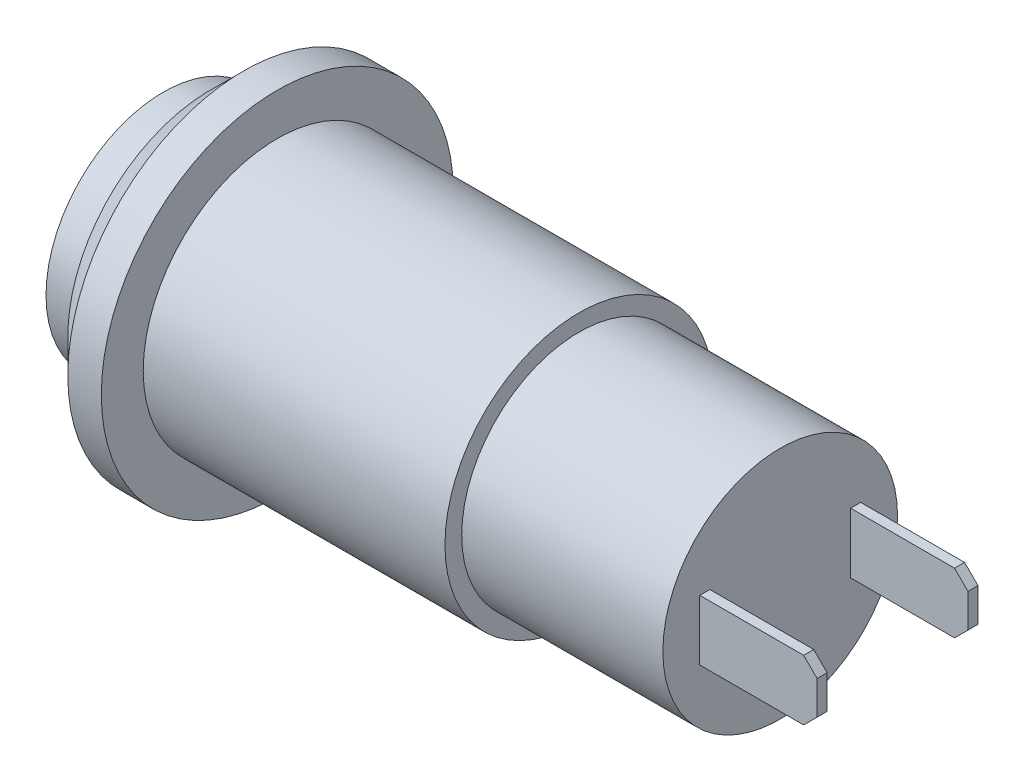
ISO-10303-21;
HEADER;
FILE_DESCRIPTION(('STEP AP214'),'2;1');
FILE_NAME('part.step','',(''),(''),'','','');
FILE_SCHEMA(('AUTOMOTIVE_DESIGN { 1 0 10303 214 1 1 1 1 }'));
ENDSEC;
DATA;
#1=APPLICATION_CONTEXT('core data for automotive mechanical design processes');
#2=APPLICATION_PROTOCOL_DEFINITION('international standard','automotive_design',2000,#1);
#3=PRODUCT_CONTEXT('',#1,'mechanical');
#4=PRODUCT('Part','Part','',(#3));
#5=PRODUCT_RELATED_PRODUCT_CATEGORY('part','',(#4));
#6=PRODUCT_DEFINITION_FORMATION('','',#4);
#7=PRODUCT_DEFINITION_CONTEXT('part definition',#1,'design');
#8=PRODUCT_DEFINITION('design','',#6,#7);
#9=PRODUCT_DEFINITION_SHAPE('','',#8);
#10=(LENGTH_UNIT() NAMED_UNIT(*) SI_UNIT(.MILLI.,.METRE.));
#11=(NAMED_UNIT(*) PLANE_ANGLE_UNIT() SI_UNIT($,.RADIAN.));
#12=(NAMED_UNIT(*) SI_UNIT($,.STERADIAN.) SOLID_ANGLE_UNIT());
#13=UNCERTAINTY_MEASURE_WITH_UNIT(LENGTH_MEASURE(1.E-05),#10,'distance_accuracy_value','');
#14=(GEOMETRIC_REPRESENTATION_CONTEXT(3) GLOBAL_UNCERTAINTY_ASSIGNED_CONTEXT((#13)) GLOBAL_UNIT_ASSIGNED_CONTEXT((#10,
#11,#12)) REPRESENTATION_CONTEXT('',''));
#15=CARTESIAN_POINT('',(0.,0.,0.));
#16=DIRECTION('',(0.,0.,1.));
#17=DIRECTION('',(1.,0.,0.));
#18=AXIS2_PLACEMENT_3D('',#15,#16,#17);
#19=CARTESIAN_POINT('',(18.4,0.,0.));
#20=DIRECTION('',(-1.,0.,0.));
#21=DIRECTION('',(0.,0.,1.));
#22=AXIS2_PLACEMENT_3D('',#19,#20,#21);
#23=PLANE('',#22);
#24=DIRECTION('',(0.,1.,0.));
#25=VECTOR('',#24,1.);
#26=CARTESIAN_POINT('',(18.4,-0.9,2.1));
#27=LINE('',#26,#25);
#28=CARTESIAN_POINT('',(18.4,-0.9,2.1));
#29=VERTEX_POINT('',#28);
#30=CARTESIAN_POINT('',(18.4,0.9,2.1));
#31=VERTEX_POINT('',#30);
#32=EDGE_CURVE('E169',#29,#31,#27,.T.);
#33=ORIENTED_EDGE('',*,*,#32,.F.);
#34=DIRECTION('',(0.,0.,-1.));
#35=VECTOR('',#34,1.);
#36=CARTESIAN_POINT('',(18.4,-0.9,2.4));
#37=LINE('',#36,#35);
#38=CARTESIAN_POINT('',(18.4,-0.9,2.4));
#39=VERTEX_POINT('',#38);
#40=EDGE_CURVE('E174',#39,#29,#37,.T.);
#41=ORIENTED_EDGE('',*,*,#40,.F.);
#42=DIRECTION('',(0.,-1.,0.));
#43=VECTOR('',#42,1.);
#44=CARTESIAN_POINT('',(18.4,-0.9,2.4));
#45=LINE('',#44,#43);
#46=CARTESIAN_POINT('',(18.4,0.9,2.4));
#47=VERTEX_POINT('',#46);
#48=EDGE_CURVE('E183',#47,#39,#45,.T.);
#49=ORIENTED_EDGE('',*,*,#48,.F.);
#50=DIRECTION('',(0.,0.,1.));
#51=VECTOR('',#50,1.);
#52=CARTESIAN_POINT('',(18.4,0.9,2.4));
#53=LINE('',#52,#51);
#54=EDGE_CURVE('E180',#31,#47,#53,.T.);
#55=ORIENTED_EDGE('',*,*,#54,.F.);
#56=EDGE_LOOP('',(#33,#41,#49,#55));
#57=FACE_BOUND('',#56,.T.);
#58=CARTESIAN_POINT('',(18.4,0.,0.));
#59=DIRECTION('',(-1.,0.,0.));
#60=DIRECTION('',(0.,0.,1.));
#61=AXIS2_PLACEMENT_3D('',#58,#59,#60);
#62=CIRCLE('',#61,3.5);
#63=CARTESIAN_POINT('',(18.4,0.,3.5));
#64=VERTEX_POINT('',#63);
#65=EDGE_CURVE('E213',#64,#64,#62,.T.);
#66=ORIENTED_EDGE('',*,*,#65,.F.);
#67=EDGE_LOOP('',(#66));
#68=FACE_BOUND('',#67,.T.);
#69=DIRECTION('',(0.,1.,0.));
#70=VECTOR('',#69,1.);
#71=CARTESIAN_POINT('',(18.4,-0.9,-2.4));
#72=LINE('',#71,#70);
#73=CARTESIAN_POINT('',(18.4,-0.9,-2.4));
#74=VERTEX_POINT('',#73);
#75=CARTESIAN_POINT('',(18.4,0.9,-2.4));
#76=VERTEX_POINT('',#75);
#77=EDGE_CURVE('E137',#74,#76,#72,.T.);
#78=ORIENTED_EDGE('',*,*,#77,.F.);
#79=DIRECTION('',(0.,0.,-1.));
#80=VECTOR('',#79,1.);
#81=CARTESIAN_POINT('',(18.4,-0.9,-2.1));
#82=LINE('',#81,#80);
#83=CARTESIAN_POINT('',(18.4,-0.9,-2.1));
#84=VERTEX_POINT('',#83);
#85=EDGE_CURVE('E149',#84,#74,#82,.T.);
#86=ORIENTED_EDGE('',*,*,#85,.F.);
#87=DIRECTION('',(0.,-1.,0.));
#88=VECTOR('',#87,1.);
#89=CARTESIAN_POINT('',(18.4,-0.9,-2.1));
#90=LINE('',#89,#88);
#91=CARTESIAN_POINT('',(18.4,0.9,-2.1));
#92=VERTEX_POINT('',#91);
#93=EDGE_CURVE('E157',#92,#84,#90,.T.);
#94=ORIENTED_EDGE('',*,*,#93,.F.);
#95=DIRECTION('',(0.,0.,1.));
#96=VECTOR('',#95,1.);
#97=CARTESIAN_POINT('',(18.4,0.9,-2.1));
#98=LINE('',#97,#96);
#99=EDGE_CURVE('E152',#76,#92,#98,.T.);
#100=ORIENTED_EDGE('',*,*,#99,.F.);
#101=EDGE_LOOP('',(#78,#86,#94,#100));
#102=FACE_BOUND('',#101,.T.);
#103=ADVANCED_FACE('F42',(#57,#68,#102),#23,.F.);
#104=CARTESIAN_POINT('',(0.,0.,0.));
#105=DIRECTION('',(-1.,0.,0.));
#106=DIRECTION('',(0.,0.,1.));
#107=AXIS2_PLACEMENT_3D('',#104,#105,#106);
#108=CYLINDRICAL_SURFACE('',#107,3.5);
#109=CARTESIAN_POINT('',(12.4,0.,0.));
#110=DIRECTION('',(-1.,0.,0.));
#111=DIRECTION('',(0.,0.,1.));
#112=AXIS2_PLACEMENT_3D('',#109,#110,#111);
#113=CIRCLE('',#112,3.5);
#114=CARTESIAN_POINT('',(12.4,0.,3.5));
#115=VERTEX_POINT('',#114);
#116=EDGE_CURVE('E210',#115,#115,#113,.T.);
#117=ORIENTED_EDGE('',*,*,#116,.F.);
#118=EDGE_LOOP('',(#117));
#119=FACE_BOUND('',#118,.T.);
#120=ORIENTED_EDGE('',*,*,#65,.T.);
#121=EDGE_LOOP('',(#120));
#122=FACE_BOUND('',#121,.T.);
#123=ADVANCED_FACE('F280',(#119,#122),#108,.T.);
#124=CARTESIAN_POINT('',(12.4,3.5,0.));
#125=DIRECTION('',(-1.,0.,0.));
#126=DIRECTION('',(0.,0.,1.));
#127=AXIS2_PLACEMENT_3D('',#124,#125,#126);
#128=PLANE('',#127);
#129=CARTESIAN_POINT('',(12.4,0.,0.));
#130=DIRECTION('',(-1.,0.,0.));
#131=DIRECTION('',(0.,0.,1.));
#132=AXIS2_PLACEMENT_3D('',#129,#130,#131);
#133=CIRCLE('',#132,4.);
#134=CARTESIAN_POINT('',(12.4,0.,4.));
#135=VERTEX_POINT('',#134);
#136=EDGE_CURVE('E207',#135,#135,#133,.T.);
#137=ORIENTED_EDGE('',*,*,#136,.F.);
#138=EDGE_LOOP('',(#137));
#139=FACE_BOUND('',#138,.T.);
#140=ORIENTED_EDGE('',*,*,#116,.T.);
#141=EDGE_LOOP('',(#140));
#142=FACE_BOUND('',#141,.T.);
#143=ADVANCED_FACE('F285',(#139,#142),#128,.F.);
#144=CARTESIAN_POINT('',(0.,0.,0.));
#145=DIRECTION('',(-1.,0.,0.));
#146=DIRECTION('',(0.,0.,1.));
#147=AXIS2_PLACEMENT_3D('',#144,#145,#146);
#148=CYLINDRICAL_SURFACE('',#147,4.);
#149=CARTESIAN_POINT('',(3.4,0.,0.));
#150=DIRECTION('',(-1.,0.,0.));
#151=DIRECTION('',(0.,0.,1.));
#152=AXIS2_PLACEMENT_3D('',#149,#150,#151);
#153=CIRCLE('',#152,4.);
#154=CARTESIAN_POINT('',(3.4,0.,4.));
#155=VERTEX_POINT('',#154);
#156=EDGE_CURVE('E204',#155,#155,#153,.T.);
#157=ORIENTED_EDGE('',*,*,#156,.F.);
#158=EDGE_LOOP('',(#157));
#159=FACE_BOUND('',#158,.T.);
#160=ORIENTED_EDGE('',*,*,#136,.T.);
#161=EDGE_LOOP('',(#160));
#162=FACE_BOUND('',#161,.T.);
#163=ADVANCED_FACE('F370',(#159,#162),#148,.T.);
#164=CARTESIAN_POINT('',(3.4,4.,0.));
#165=DIRECTION('',(-1.,0.,0.));
#166=DIRECTION('',(0.,0.,1.));
#167=AXIS2_PLACEMENT_3D('',#164,#165,#166);
#168=PLANE('',#167);
#169=CARTESIAN_POINT('',(3.4,0.,0.));
#170=DIRECTION('',(-1.,0.,0.));
#171=DIRECTION('',(0.,0.,1.));
#172=AXIS2_PLACEMENT_3D('',#169,#170,#171);
#173=CIRCLE('',#172,5.25);
#174=CARTESIAN_POINT('',(3.4,0.,5.25));
#175=VERTEX_POINT('',#174);
#176=EDGE_CURVE('E201',#175,#175,#173,.T.);
#177=ORIENTED_EDGE('',*,*,#176,.F.);
#178=EDGE_LOOP('',(#177));
#179=FACE_BOUND('',#178,.T.);
#180=ORIENTED_EDGE('',*,*,#156,.T.);
#181=EDGE_LOOP('',(#180));
#182=FACE_BOUND('',#181,.T.);
#183=ADVANCED_FACE('F366',(#179,#182),#168,.F.);
#184=CARTESIAN_POINT('',(0.,0.,0.));
#185=DIRECTION('',(-1.,0.,0.));
#186=DIRECTION('',(0.,0.,1.));
#187=AXIS2_PLACEMENT_3D('',#184,#185,#186);
#188=CYLINDRICAL_SURFACE('',#187,5.25);
#189=CARTESIAN_POINT('',(2.4,0.,0.));
#190=DIRECTION('',(1.,0.,0.));
#191=DIRECTION('',(0.,0.,-1.));
#192=AXIS2_PLACEMENT_3D('',#189,#190,#191);
#193=CIRCLE('',#192,5.25);
#194=CARTESIAN_POINT('',(2.4,0.,-5.25));
#195=VERTEX_POINT('',#194);
#196=EDGE_CURVE('E219',#195,#195,#193,.T.);
#197=ORIENTED_EDGE('',*,*,#196,.T.);
#198=EDGE_LOOP('',(#197));
#199=FACE_BOUND('',#198,.T.);
#200=ORIENTED_EDGE('',*,*,#176,.T.);
#201=EDGE_LOOP('',(#200));
#202=FACE_BOUND('',#201,.T.);
#203=ADVANCED_FACE('F362',(#199,#202),#188,.T.);
#204=CARTESIAN_POINT('',(1.4,5.25,0.));
#205=DIRECTION('',(1.,0.,0.));
#206=DIRECTION('',(0.,0.,-1.));
#207=AXIS2_PLACEMENT_3D('',#204,#205,#206);
#208=PLANE('',#207);
#209=CARTESIAN_POINT('',(1.4,0.,0.));
#210=DIRECTION('',(1.,0.,0.));
#211=DIRECTION('',(0.,0.,-1.));
#212=AXIS2_PLACEMENT_3D('',#209,#210,#211);
#213=CIRCLE('',#212,4.25);
#214=CARTESIAN_POINT('',(1.4,0.,-4.25));
#215=VERTEX_POINT('',#214);
#216=EDGE_CURVE('E216',#215,#215,#213,.F.);
#217=ORIENTED_EDGE('',*,*,#216,.T.);
#218=EDGE_LOOP('',(#217));
#219=FACE_BOUND('',#218,.T.);
#220=CARTESIAN_POINT('',(1.4,0.,0.));
#221=DIRECTION('',(-1.,0.,0.));
#222=DIRECTION('',(0.,0.,1.));
#223=AXIS2_PLACEMENT_3D('',#220,#221,#222);
#224=CIRCLE('',#223,3.5);
#225=CARTESIAN_POINT('',(1.4,0.,3.5));
#226=VERTEX_POINT('',#225);
#227=EDGE_CURVE('E198',#226,#226,#224,.T.);
#228=ORIENTED_EDGE('',*,*,#227,.F.);
#229=EDGE_LOOP('',(#228));
#230=FACE_BOUND('',#229,.T.);
#231=ADVANCED_FACE('F358',(#219,#230),#208,.F.);
#232=CARTESIAN_POINT('',(0.,0.,0.));
#233=DIRECTION('',(-1.,0.,0.));
#234=DIRECTION('',(0.,0.,1.));
#235=AXIS2_PLACEMENT_3D('',#232,#233,#234);
#236=CYLINDRICAL_SURFACE('',#235,3.5);
#237=CARTESIAN_POINT('',(0.,0.,0.));
#238=DIRECTION('',(-1.,0.,0.));
#239=DIRECTION('',(0.,0.,1.));
#240=AXIS2_PLACEMENT_3D('',#237,#238,#239);
#241=CIRCLE('',#240,3.5);
#242=CARTESIAN_POINT('',(0.,0.,3.5));
#243=VERTEX_POINT('',#242);
#244=EDGE_CURVE('E195',#243,#243,#241,.T.);
#245=ORIENTED_EDGE('',*,*,#244,.F.);
#246=EDGE_LOOP('',(#245));
#247=FACE_BOUND('',#246,.T.);
#248=ORIENTED_EDGE('',*,*,#227,.T.);
#249=EDGE_LOOP('',(#248));
#250=FACE_BOUND('',#249,.T.);
#251=ADVANCED_FACE('F354',(#247,#250),#236,.T.);
#252=CARTESIAN_POINT('',(0.,3.5,0.));
#253=DIRECTION('',(1.,0.,0.));
#254=DIRECTION('',(0.,0.,-1.));
#255=AXIS2_PLACEMENT_3D('',#252,#253,#254);
#256=PLANE('',#255);
#257=ORIENTED_EDGE('',*,*,#244,.T.);
#258=EDGE_LOOP('',(#257));
#259=FACE_BOUND('',#258,.T.);
#260=ADVANCED_FACE('F297',(#259),#256,.F.);
#261=CARTESIAN_POINT('',(1.4,0.,0.));
#262=DIRECTION('',(1.,0.,0.));
#263=DIRECTION('',(0.,0.,-1.));
#264=AXIS2_PLACEMENT_3D('',#261,#262,#263);
#265=CONICAL_SURFACE('',#264,4.25,0.785398163397447);
#266=ORIENTED_EDGE('',*,*,#196,.F.);
#267=EDGE_LOOP('',(#266));
#268=FACE_BOUND('',#267,.T.);
#269=ORIENTED_EDGE('',*,*,#216,.F.);
#270=EDGE_LOOP('',(#269));
#271=FACE_BOUND('',#270,.T.);
#272=ADVANCED_FACE('F291',(#268,#271),#265,.T.);
#273=CARTESIAN_POINT('',(21.9,-0.9,2.1));
#274=DIRECTION('',(0.,0.,1.));
#275=DIRECTION('',(1.,0.,0.));
#276=AXIS2_PLACEMENT_3D('',#273,#274,#275);
#277=PLANE('',#276);
#278=DIRECTION('',(0.,1.,0.));
#279=VECTOR('',#278,1.);
#280=CARTESIAN_POINT('',(21.9,-0.9,2.1));
#281=LINE('',#280,#279);
#282=CARTESIAN_POINT('',(21.9,-0.499999999999996,2.1));
#283=VERTEX_POINT('',#282);
#284=CARTESIAN_POINT('',(21.9,0.499999999999996,2.1));
#285=VERTEX_POINT('',#284);
#286=EDGE_CURVE('E170',#283,#285,#281,.T.);
#287=ORIENTED_EDGE('',*,*,#286,.F.);
#288=DIRECTION('',(0.707106781186548,0.707106781186548,0.));
#289=VECTOR('',#288,1.);
#290=CARTESIAN_POINT('',(21.9,-0.499999999999997,2.1));
#291=LINE('',#290,#289);
#292=CARTESIAN_POINT('',(21.5,-0.9,2.1));
#293=VERTEX_POINT('',#292);
#294=EDGE_CURVE('E247',#283,#293,#291,.F.);
#295=ORIENTED_EDGE('',*,*,#294,.T.);
#296=DIRECTION('',(-1.,0.,0.));
#297=VECTOR('',#296,1.);
#298=CARTESIAN_POINT('',(21.9,-0.9,2.1));
#299=LINE('',#298,#297);
#300=EDGE_CURVE('E177',#293,#29,#299,.T.);
#301=ORIENTED_EDGE('',*,*,#300,.T.);
#302=ORIENTED_EDGE('',*,*,#32,.T.);
#303=DIRECTION('',(-1.,0.,0.));
#304=VECTOR('',#303,1.);
#305=CARTESIAN_POINT('',(21.9,0.9,2.1));
#306=LINE('',#305,#304);
#307=CARTESIAN_POINT('',(21.5,0.9,2.1));
#308=VERTEX_POINT('',#307);
#309=EDGE_CURVE('E193',#308,#31,#306,.T.);
#310=ORIENTED_EDGE('',*,*,#309,.F.);
#311=DIRECTION('',(-0.707106781186548,0.707106781186548,0.));
#312=VECTOR('',#311,1.);
#313=CARTESIAN_POINT('',(21.9,0.499999999999995,2.1));
#314=LINE('',#313,#312);
#315=EDGE_CURVE('E245',#308,#285,#314,.F.);
#316=ORIENTED_EDGE('',*,*,#315,.T.);
#317=EDGE_LOOP('',(#287,#295,#301,#302,#310,#316));
#318=FACE_BOUND('',#317,.T.);
#319=ADVANCED_FACE('F260',(#318),#277,.F.);
#320=CARTESIAN_POINT('',(21.9,0.9,2.4));
#321=DIRECTION('',(0.,-1.,0.));
#322=DIRECTION('',(0.,0.,-1.));
#323=AXIS2_PLACEMENT_3D('',#320,#321,#322);
#324=PLANE('',#323);
#325=DIRECTION('',(-1.,0.,0.));
#326=VECTOR('',#325,1.);
#327=CARTESIAN_POINT('',(21.9,0.9,2.4));
#328=LINE('',#327,#326);
#329=CARTESIAN_POINT('',(21.5,0.9,2.4));
#330=VERTEX_POINT('',#329);
#331=EDGE_CURVE('E191',#330,#47,#328,.T.);
#332=ORIENTED_EDGE('',*,*,#331,.F.);
#333=DIRECTION('',(0.,0.,-1.));
#334=VECTOR('',#333,1.);
#335=CARTESIAN_POINT('',(21.5,0.9,2.4));
#336=LINE('',#335,#334);
#337=EDGE_CURVE('E11',#330,#308,#336,.T.);
#338=ORIENTED_EDGE('',*,*,#337,.T.);
#339=ORIENTED_EDGE('',*,*,#309,.T.);
#340=ORIENTED_EDGE('',*,*,#54,.T.);
#341=EDGE_LOOP('',(#332,#338,#339,#340));
#342=FACE_BOUND('',#341,.T.);
#343=ADVANCED_FACE('F270',(#342),#324,.F.);
#344=CARTESIAN_POINT('',(21.9,-0.9,2.4));
#345=DIRECTION('',(0.,0.,-1.));
#346=DIRECTION('',(-1.,0.,0.));
#347=AXIS2_PLACEMENT_3D('',#344,#345,#346);
#348=PLANE('',#347);
#349=DIRECTION('',(-1.,0.,0.));
#350=VECTOR('',#349,1.);
#351=CARTESIAN_POINT('',(21.9,-0.9,2.4));
#352=LINE('',#351,#350);
#353=CARTESIAN_POINT('',(21.5,-0.9,2.4));
#354=VERTEX_POINT('',#353);
#355=EDGE_CURVE('E189',#354,#39,#352,.T.);
#356=ORIENTED_EDGE('',*,*,#355,.F.);
#357=DIRECTION('',(-0.707106781186548,-0.707106781186548,0.));
#358=VECTOR('',#357,1.);
#359=CARTESIAN_POINT('',(21.9,-0.499999999999997,2.4));
#360=LINE('',#359,#358);
#361=CARTESIAN_POINT('',(21.9,-0.499999999999995,2.4));
#362=VERTEX_POINT('',#361);
#363=EDGE_CURVE('E51',#354,#362,#360,.F.);
#364=ORIENTED_EDGE('',*,*,#363,.T.);
#365=DIRECTION('',(0.,-1.,0.));
#366=VECTOR('',#365,1.);
#367=CARTESIAN_POINT('',(21.9,-0.9,2.4));
#368=LINE('',#367,#366);
#369=CARTESIAN_POINT('',(21.9,0.499999999999995,2.4));
#370=VERTEX_POINT('',#369);
#371=EDGE_CURVE('E173',#370,#362,#368,.T.);
#372=ORIENTED_EDGE('',*,*,#371,.F.);
#373=DIRECTION('',(0.707106781186548,-0.707106781186548,0.));
#374=VECTOR('',#373,1.);
#375=CARTESIAN_POINT('',(21.9,0.499999999999995,2.4));
#376=LINE('',#375,#374);
#377=EDGE_CURVE('E58',#370,#330,#376,.F.);
#378=ORIENTED_EDGE('',*,*,#377,.T.);
#379=ORIENTED_EDGE('',*,*,#331,.T.);
#380=ORIENTED_EDGE('',*,*,#48,.T.);
#381=EDGE_LOOP('',(#356,#364,#372,#378,#379,#380));
#382=FACE_BOUND('',#381,.T.);
#383=ADVANCED_FACE('F251',(#382),#348,.F.);
#384=CARTESIAN_POINT('',(21.9,-0.9,2.4));
#385=DIRECTION('',(0.,1.,0.));
#386=DIRECTION('',(0.,0.,1.));
#387=AXIS2_PLACEMENT_3D('',#384,#385,#386);
#388=PLANE('',#387);
#389=ORIENTED_EDGE('',*,*,#300,.F.);
#390=DIRECTION('',(0.,0.,1.));
#391=VECTOR('',#390,1.);
#392=CARTESIAN_POINT('',(21.5,-0.9,2.4));
#393=LINE('',#392,#391);
#394=EDGE_CURVE('E66',#293,#354,#393,.T.);
#395=ORIENTED_EDGE('',*,*,#394,.T.);
#396=ORIENTED_EDGE('',*,*,#355,.T.);
#397=ORIENTED_EDGE('',*,*,#40,.T.);
#398=EDGE_LOOP('',(#389,#395,#396,#397));
#399=FACE_BOUND('',#398,.T.);
#400=ADVANCED_FACE('F262',(#399),#388,.F.);
#401=CARTESIAN_POINT('',(21.9,0.,0.));
#402=DIRECTION('',(-1.,0.,0.));
#403=DIRECTION('',(0.,0.,1.));
#404=AXIS2_PLACEMENT_3D('',#401,#402,#403);
#405=PLANE('',#404);
#406=ORIENTED_EDGE('',*,*,#371,.T.);
#407=DIRECTION('',(0.,0.,-1.));
#408=VECTOR('',#407,1.);
#409=CARTESIAN_POINT('',(21.9,-0.499999999999998,0.));
#410=LINE('',#409,#408);
#411=EDGE_CURVE('E242',#362,#283,#410,.T.);
#412=ORIENTED_EDGE('',*,*,#411,.T.);
#413=ORIENTED_EDGE('',*,*,#286,.T.);
#414=DIRECTION('',(0.,0.,1.));
#415=VECTOR('',#414,1.);
#416=CARTESIAN_POINT('',(21.9,0.499999999999995,0.));
#417=LINE('',#416,#415);
#418=EDGE_CURVE('E239',#285,#370,#417,.T.);
#419=ORIENTED_EDGE('',*,*,#418,.T.);
#420=EDGE_LOOP('',(#406,#412,#413,#419));
#421=FACE_BOUND('',#420,.T.);
#422=ADVANCED_FACE('F255',(#421),#405,.F.);
#423=CARTESIAN_POINT('',(21.9,-0.9,-2.4));
#424=DIRECTION('',(0.,0.,1.));
#425=DIRECTION('',(1.,0.,0.));
#426=AXIS2_PLACEMENT_3D('',#423,#424,#425);
#427=PLANE('',#426);
#428=DIRECTION('',(0.,1.,0.));
#429=VECTOR('',#428,1.);
#430=CARTESIAN_POINT('',(21.9,-0.9,-2.4));
#431=LINE('',#430,#429);
#432=CARTESIAN_POINT('',(21.9,-0.499999999999996,-2.4));
#433=VERTEX_POINT('',#432);
#434=CARTESIAN_POINT('',(21.9,0.499999999999995,-2.4));
#435=VERTEX_POINT('',#434);
#436=EDGE_CURVE('E156',#433,#435,#431,.T.);
#437=ORIENTED_EDGE('',*,*,#436,.F.);
#438=DIRECTION('',(0.707106781186548,0.707106781186548,0.));
#439=VECTOR('',#438,1.);
#440=CARTESIAN_POINT('',(21.9,-0.499999999999996,-2.4));
#441=LINE('',#440,#439);
#442=CARTESIAN_POINT('',(21.5,-0.9,-2.4));
#443=VERTEX_POINT('',#442);
#444=EDGE_CURVE('E138',#433,#443,#441,.F.);
#445=ORIENTED_EDGE('',*,*,#444,.T.);
#446=DIRECTION('',(-1.,0.,0.));
#447=VECTOR('',#446,1.);
#448=CARTESIAN_POINT('',(21.9,-0.9,-2.4));
#449=LINE('',#448,#447);
#450=EDGE_CURVE('E132',#443,#74,#449,.T.);
#451=ORIENTED_EDGE('',*,*,#450,.T.);
#452=ORIENTED_EDGE('',*,*,#77,.T.);
#453=DIRECTION('',(-1.,0.,0.));
#454=VECTOR('',#453,1.);
#455=CARTESIAN_POINT('',(21.9,0.9,-2.4));
#456=LINE('',#455,#454);
#457=CARTESIAN_POINT('',(21.5,0.9,-2.4));
#458=VERTEX_POINT('',#457);
#459=EDGE_CURVE('E167',#458,#76,#456,.T.);
#460=ORIENTED_EDGE('',*,*,#459,.F.);
#461=DIRECTION('',(-0.707106781186548,0.707106781186548,0.));
#462=VECTOR('',#461,1.);
#463=CARTESIAN_POINT('',(21.9,0.499999999999996,-2.4));
#464=LINE('',#463,#462);
#465=EDGE_CURVE('E228',#458,#435,#464,.F.);
#466=ORIENTED_EDGE('',*,*,#465,.T.);
#467=EDGE_LOOP('',(#437,#445,#451,#452,#460,#466));
#468=FACE_BOUND('',#467,.T.);
#469=ADVANCED_FACE('F135',(#468),#427,.F.);
#470=CARTESIAN_POINT('',(21.9,0.9,-2.1));
#471=DIRECTION('',(0.,-1.,0.));
#472=DIRECTION('',(0.,0.,-1.));
#473=AXIS2_PLACEMENT_3D('',#470,#471,#472);
#474=PLANE('',#473);
#475=DIRECTION('',(-1.,0.,0.));
#476=VECTOR('',#475,1.);
#477=CARTESIAN_POINT('',(21.9,0.9,-2.1));
#478=LINE('',#477,#476);
#479=CARTESIAN_POINT('',(21.5,0.9,-2.1));
#480=VERTEX_POINT('',#479);
#481=EDGE_CURVE('E165',#480,#92,#478,.T.);
#482=ORIENTED_EDGE('',*,*,#481,.F.);
#483=DIRECTION('',(0.,0.,-1.));
#484=VECTOR('',#483,1.);
#485=CARTESIAN_POINT('',(21.5,0.9,-2.1));
#486=LINE('',#485,#484);
#487=EDGE_CURVE('E237',#480,#458,#486,.T.);
#488=ORIENTED_EDGE('',*,*,#487,.T.);
#489=ORIENTED_EDGE('',*,*,#459,.T.);
#490=ORIENTED_EDGE('',*,*,#99,.T.);
#491=EDGE_LOOP('',(#482,#488,#489,#490));
#492=FACE_BOUND('',#491,.T.);
#493=ADVANCED_FACE('F330',(#492),#474,.F.);
#494=CARTESIAN_POINT('',(21.9,-0.9,-2.1));
#495=DIRECTION('',(0.,0.,-1.));
#496=DIRECTION('',(-1.,0.,0.));
#497=AXIS2_PLACEMENT_3D('',#494,#495,#496);
#498=PLANE('',#497);
#499=DIRECTION('',(-1.,0.,0.));
#500=VECTOR('',#499,1.);
#501=CARTESIAN_POINT('',(21.9,-0.9,-2.1));
#502=LINE('',#501,#500);
#503=CARTESIAN_POINT('',(21.5,-0.9,-2.1));
#504=VERTEX_POINT('',#503);
#505=EDGE_CURVE('E142',#504,#84,#502,.T.);
#506=ORIENTED_EDGE('',*,*,#505,.F.);
#507=DIRECTION('',(-0.707106781186548,-0.707106781186548,0.));
#508=VECTOR('',#507,1.);
#509=CARTESIAN_POINT('',(21.9,-0.499999999999996,-2.1));
#510=LINE('',#509,#508);
#511=CARTESIAN_POINT('',(21.9,-0.499999999999996,-2.1));
#512=VERTEX_POINT('',#511);
#513=EDGE_CURVE('E235',#504,#512,#510,.F.);
#514=ORIENTED_EDGE('',*,*,#513,.T.);
#515=DIRECTION('',(0.,-1.,0.));
#516=VECTOR('',#515,1.);
#517=CARTESIAN_POINT('',(21.9,-0.9,-2.1));
#518=LINE('',#517,#516);
#519=CARTESIAN_POINT('',(21.9,0.499999999999996,-2.1));
#520=VERTEX_POINT('',#519);
#521=EDGE_CURVE('E143',#520,#512,#518,.T.);
#522=ORIENTED_EDGE('',*,*,#521,.F.);
#523=DIRECTION('',(0.707106781186548,-0.707106781186548,0.));
#524=VECTOR('',#523,1.);
#525=CARTESIAN_POINT('',(21.9,0.499999999999997,-2.1));
#526=LINE('',#525,#524);
#527=EDGE_CURVE('E233',#520,#480,#526,.F.);
#528=ORIENTED_EDGE('',*,*,#527,.T.);
#529=ORIENTED_EDGE('',*,*,#481,.T.);
#530=ORIENTED_EDGE('',*,*,#93,.T.);
#531=EDGE_LOOP('',(#506,#514,#522,#528,#529,#530));
#532=FACE_BOUND('',#531,.T.);
#533=ADVANCED_FACE('F327',(#532),#498,.F.);
#534=CARTESIAN_POINT('',(21.9,-0.9,-2.1));
#535=DIRECTION('',(0.,1.,0.));
#536=DIRECTION('',(0.,0.,1.));
#537=AXIS2_PLACEMENT_3D('',#534,#535,#536);
#538=PLANE('',#537);
#539=ORIENTED_EDGE('',*,*,#450,.F.);
#540=DIRECTION('',(0.,0.,1.));
#541=VECTOR('',#540,1.);
#542=CARTESIAN_POINT('',(21.5,-0.9,-2.1));
#543=LINE('',#542,#541);
#544=EDGE_CURVE('E231',#443,#504,#543,.T.);
#545=ORIENTED_EDGE('',*,*,#544,.T.);
#546=ORIENTED_EDGE('',*,*,#505,.T.);
#547=ORIENTED_EDGE('',*,*,#85,.T.);
#548=EDGE_LOOP('',(#539,#545,#546,#547));
#549=FACE_BOUND('',#548,.T.);
#550=ADVANCED_FACE('F154',(#549),#538,.F.);
#551=CARTESIAN_POINT('',(21.9,0.,0.));
#552=DIRECTION('',(-1.,0.,0.));
#553=DIRECTION('',(0.,0.,1.));
#554=AXIS2_PLACEMENT_3D('',#551,#552,#553);
#555=PLANE('',#554);
#556=ORIENTED_EDGE('',*,*,#521,.T.);
#557=DIRECTION('',(0.,0.,-1.));
#558=VECTOR('',#557,1.);
#559=CARTESIAN_POINT('',(21.9,-0.499999999999996,0.));
#560=LINE('',#559,#558);
#561=EDGE_CURVE('E225',#512,#433,#560,.T.);
#562=ORIENTED_EDGE('',*,*,#561,.T.);
#563=ORIENTED_EDGE('',*,*,#436,.T.);
#564=DIRECTION('',(0.,0.,1.));
#565=VECTOR('',#564,1.);
#566=CARTESIAN_POINT('',(21.9,0.499999999999998,0.));
#567=LINE('',#566,#565);
#568=EDGE_CURVE('E222',#435,#520,#567,.T.);
#569=ORIENTED_EDGE('',*,*,#568,.T.);
#570=EDGE_LOOP('',(#556,#562,#563,#569));
#571=FACE_BOUND('',#570,.T.);
#572=ADVANCED_FACE('F305',(#571),#555,.F.);
#573=CARTESIAN_POINT('',(21.9,-0.499999999999996,0.));
#574=DIRECTION('',(-0.707106781186547,0.707106781186547,0.));
#575=DIRECTION('',(0.,0.,-1.));
#576=AXIS2_PLACEMENT_3D('',#573,#574,#575);
#577=PLANE('',#576);
#578=ORIENTED_EDGE('',*,*,#513,.F.);
#579=ORIENTED_EDGE('',*,*,#544,.F.);
#580=ORIENTED_EDGE('',*,*,#444,.F.);
#581=ORIENTED_EDGE('',*,*,#561,.F.);
#582=EDGE_LOOP('',(#578,#579,#580,#581));
#583=FACE_BOUND('',#582,.T.);
#584=ADVANCED_FACE('F299',(#583),#577,.F.);
#585=CARTESIAN_POINT('',(21.9,0.499999999999998,0.));
#586=DIRECTION('',(-0.707106781186547,-0.707106781186547,0.));
#587=DIRECTION('',(0.,0.,1.));
#588=AXIS2_PLACEMENT_3D('',#585,#586,#587);
#589=PLANE('',#588);
#590=ORIENTED_EDGE('',*,*,#465,.F.);
#591=ORIENTED_EDGE('',*,*,#487,.F.);
#592=ORIENTED_EDGE('',*,*,#527,.F.);
#593=ORIENTED_EDGE('',*,*,#568,.F.);
#594=EDGE_LOOP('',(#590,#591,#592,#593));
#595=FACE_BOUND('',#594,.T.);
#596=ADVANCED_FACE('F278',(#595),#589,.F.);
#597=CARTESIAN_POINT('',(21.9,-0.499999999999998,0.));
#598=DIRECTION('',(-0.707106781186547,0.707106781186547,0.));
#599=DIRECTION('',(0.,0.,-1.));
#600=AXIS2_PLACEMENT_3D('',#597,#598,#599);
#601=PLANE('',#600);
#602=ORIENTED_EDGE('',*,*,#363,.F.);
#603=ORIENTED_EDGE('',*,*,#394,.F.);
#604=ORIENTED_EDGE('',*,*,#294,.F.);
#605=ORIENTED_EDGE('',*,*,#411,.F.);
#606=EDGE_LOOP('',(#602,#603,#604,#605));
#607=FACE_BOUND('',#606,.T.);
#608=ADVANCED_FACE('F258',(#607),#601,.F.);
#609=CARTESIAN_POINT('',(21.9,0.499999999999995,0.));
#610=DIRECTION('',(-0.707106781186547,-0.707106781186547,0.));
#611=DIRECTION('',(0.,0.,1.));
#612=AXIS2_PLACEMENT_3D('',#609,#610,#611);
#613=PLANE('',#612);
#614=ORIENTED_EDGE('',*,*,#315,.F.);
#615=ORIENTED_EDGE('',*,*,#337,.F.);
#616=ORIENTED_EDGE('',*,*,#377,.F.);
#617=ORIENTED_EDGE('',*,*,#418,.F.);
#618=EDGE_LOOP('',(#614,#615,#616,#617));
#619=FACE_BOUND('',#618,.T.);
#620=ADVANCED_FACE('F45',(#619),#613,.F.);
#621=CLOSED_SHELL('',(#103,#123,#143,#163,#183,#203,#231,#251,#260,#272,#319,#343,#383,#400,
#422,#469,#493,#533,#550,#572,#584,#596,#608,#620));
#622=MANIFOLD_SOLID_BREP('B2',#621);
#623=ADVANCED_BREP_SHAPE_REPRESENTATION('',(#18,#622),#14);
#624=SHAPE_DEFINITION_REPRESENTATION(#9,#623);
ENDSEC;
END-ISO-10303-21;
